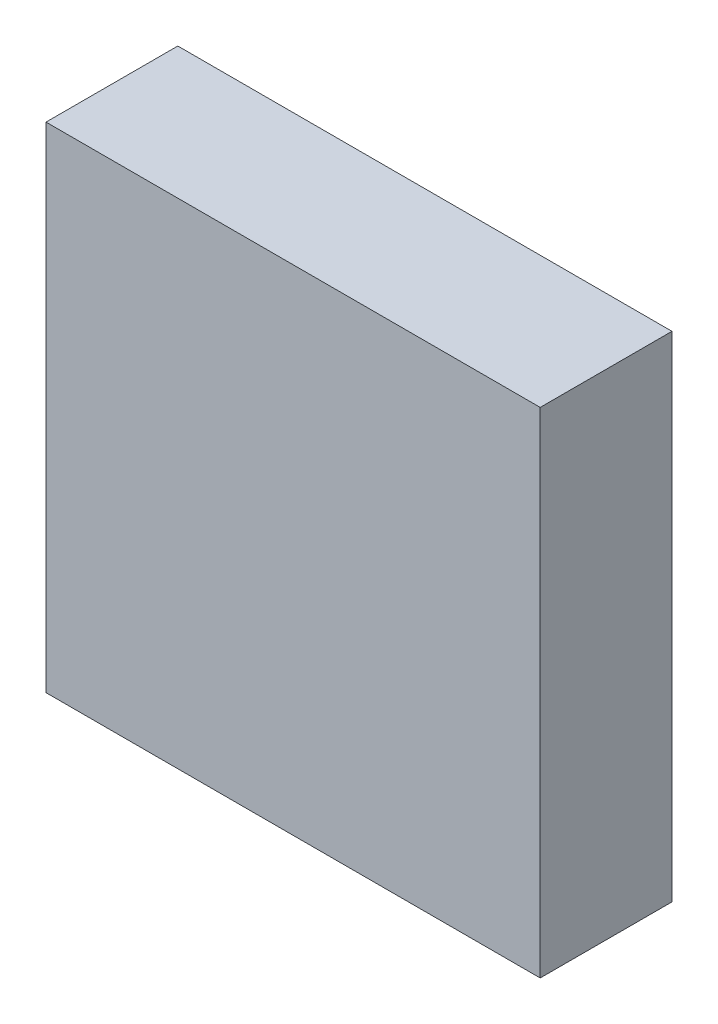
ISO-10303-21;
HEADER;
FILE_DESCRIPTION(('STEP AP214'),'2;1');
FILE_NAME('part.step','',(''),(''),'','','');
FILE_SCHEMA(('AUTOMOTIVE_DESIGN { 1 0 10303 214 1 1 1 1 }'));
ENDSEC;
DATA;
#1=APPLICATION_CONTEXT('core data for automotive mechanical design processes');
#2=APPLICATION_PROTOCOL_DEFINITION('international standard','automotive_design',2000,#1);
#3=PRODUCT_CONTEXT('',#1,'mechanical');
#4=PRODUCT('Part','Part','',(#3));
#5=PRODUCT_RELATED_PRODUCT_CATEGORY('part','',(#4));
#6=PRODUCT_DEFINITION_FORMATION('','',#4);
#7=PRODUCT_DEFINITION_CONTEXT('part definition',#1,'design');
#8=PRODUCT_DEFINITION('design','',#6,#7);
#9=PRODUCT_DEFINITION_SHAPE('','',#8);
#10=(LENGTH_UNIT() NAMED_UNIT(*) SI_UNIT(.MILLI.,.METRE.));
#11=(NAMED_UNIT(*) PLANE_ANGLE_UNIT() SI_UNIT($,.RADIAN.));
#12=(NAMED_UNIT(*) SI_UNIT($,.STERADIAN.) SOLID_ANGLE_UNIT());
#13=UNCERTAINTY_MEASURE_WITH_UNIT(LENGTH_MEASURE(1.E-05),#10,'distance_accuracy_value','');
#14=(GEOMETRIC_REPRESENTATION_CONTEXT(3) GLOBAL_UNCERTAINTY_ASSIGNED_CONTEXT((#13)) GLOBAL_UNIT_ASSIGNED_CONTEXT((#10,
#11,#12)) REPRESENTATION_CONTEXT('',''));
#15=CARTESIAN_POINT('',(0.,0.,0.));
#16=DIRECTION('',(0.,0.,1.));
#17=DIRECTION('',(1.,0.,0.));
#18=AXIS2_PLACEMENT_3D('',#15,#16,#17);
#19=CARTESIAN_POINT('',(0.,0.,40.));
#20=DIRECTION('',(1.,0.,0.));
#21=DIRECTION('',(0.,0.,-1.));
#22=AXIS2_PLACEMENT_3D('',#19,#20,#21);
#23=PLANE('',#22);
#24=DIRECTION('',(0.,-1.,0.));
#25=VECTOR('',#24,1.);
#26=CARTESIAN_POINT('',(0.,0.,0.));
#27=LINE('',#26,#25);
#28=CARTESIAN_POINT('',(0.,150.,0.));
#29=VERTEX_POINT('',#28);
#30=CARTESIAN_POINT('',(0.,0.,0.));
#31=VERTEX_POINT('',#30);
#32=EDGE_CURVE('E99',#29,#31,#27,.T.);
#33=ORIENTED_EDGE('',*,*,#32,.T.);
#34=DIRECTION('',(0.,0.,-1.));
#35=VECTOR('',#34,1.);
#36=CARTESIAN_POINT('',(0.,0.,40.));
#37=LINE('',#36,#35);
#38=CARTESIAN_POINT('',(0.,0.,40.));
#39=VERTEX_POINT('',#38);
#40=EDGE_CURVE('E11',#39,#31,#37,.T.);
#41=ORIENTED_EDGE('',*,*,#40,.F.);
#42=DIRECTION('',(0.,-1.,0.));
#43=VECTOR('',#42,1.);
#44=CARTESIAN_POINT('',(0.,0.,40.));
#45=LINE('',#44,#43);
#46=CARTESIAN_POINT('',(0.,150.,40.));
#47=VERTEX_POINT('',#46);
#48=EDGE_CURVE('E87',#47,#39,#45,.T.);
#49=ORIENTED_EDGE('',*,*,#48,.F.);
#50=DIRECTION('',(0.,0.,-1.));
#51=VECTOR('',#50,1.);
#52=CARTESIAN_POINT('',(0.,150.,40.));
#53=LINE('',#52,#51);
#54=EDGE_CURVE('E95',#47,#29,#53,.T.);
#55=ORIENTED_EDGE('',*,*,#54,.T.);
#56=EDGE_LOOP('',(#33,#41,#49,#55));
#57=FACE_BOUND('',#56,.T.);
#58=ADVANCED_FACE('F36',(#57),#23,.F.);
#59=CARTESIAN_POINT('',(0.,0.,40.));
#60=DIRECTION('',(0.,1.,0.));
#61=DIRECTION('',(0.,0.,1.));
#62=AXIS2_PLACEMENT_3D('',#59,#60,#61);
#63=PLANE('',#62);
#64=DIRECTION('',(1.,0.,0.));
#65=VECTOR('',#64,1.);
#66=CARTESIAN_POINT('',(0.,0.,0.));
#67=LINE('',#66,#65);
#68=CARTESIAN_POINT('',(150.,0.,0.));
#69=VERTEX_POINT('',#68);
#70=EDGE_CURVE('E91',#31,#69,#67,.T.);
#71=ORIENTED_EDGE('',*,*,#70,.T.);
#72=DIRECTION('',(0.,0.,-1.));
#73=VECTOR('',#72,1.);
#74=CARTESIAN_POINT('',(150.,0.,40.));
#75=LINE('',#74,#73);
#76=CARTESIAN_POINT('',(150.,0.,40.));
#77=VERTEX_POINT('',#76);
#78=EDGE_CURVE('E44',#77,#69,#75,.T.);
#79=ORIENTED_EDGE('',*,*,#78,.F.);
#80=DIRECTION('',(1.,0.,0.));
#81=VECTOR('',#80,1.);
#82=CARTESIAN_POINT('',(0.,0.,40.));
#83=LINE('',#82,#81);
#84=EDGE_CURVE('E82',#39,#77,#83,.T.);
#85=ORIENTED_EDGE('',*,*,#84,.F.);
#86=ORIENTED_EDGE('',*,*,#40,.T.);
#87=EDGE_LOOP('',(#71,#79,#85,#86));
#88=FACE_BOUND('',#87,.T.);
#89=ADVANCED_FACE('F90',(#88),#63,.F.);
#90=CARTESIAN_POINT('',(150.,0.,40.));
#91=DIRECTION('',(-1.,0.,0.));
#92=DIRECTION('',(0.,0.,1.));
#93=AXIS2_PLACEMENT_3D('',#90,#91,#92);
#94=PLANE('',#93);
#95=DIRECTION('',(0.,1.,0.));
#96=VECTOR('',#95,1.);
#97=CARTESIAN_POINT('',(150.,0.,0.));
#98=LINE('',#97,#96);
#99=CARTESIAN_POINT('',(150.,150.,0.));
#100=VERTEX_POINT('',#99);
#101=EDGE_CURVE('E69',#69,#100,#98,.T.);
#102=ORIENTED_EDGE('',*,*,#101,.T.);
#103=DIRECTION('',(0.,0.,-1.));
#104=VECTOR('',#103,1.);
#105=CARTESIAN_POINT('',(150.,150.,40.));
#106=LINE('',#105,#104);
#107=CARTESIAN_POINT('',(150.,150.,40.));
#108=VERTEX_POINT('',#107);
#109=EDGE_CURVE('E92',#108,#100,#106,.T.);
#110=ORIENTED_EDGE('',*,*,#109,.F.);
#111=DIRECTION('',(0.,1.,0.));
#112=VECTOR('',#111,1.);
#113=CARTESIAN_POINT('',(150.,0.,40.));
#114=LINE('',#113,#112);
#115=EDGE_CURVE('E85',#77,#108,#114,.T.);
#116=ORIENTED_EDGE('',*,*,#115,.F.);
#117=ORIENTED_EDGE('',*,*,#78,.T.);
#118=EDGE_LOOP('',(#102,#110,#116,#117));
#119=FACE_BOUND('',#118,.T.);
#120=ADVANCED_FACE('F93',(#119),#94,.F.);
#121=CARTESIAN_POINT('',(0.,150.,40.));
#122=DIRECTION('',(0.,-1.,0.));
#123=DIRECTION('',(0.,0.,-1.));
#124=AXIS2_PLACEMENT_3D('',#121,#122,#123);
#125=PLANE('',#124);
#126=DIRECTION('',(-1.,0.,0.));
#127=VECTOR('',#126,1.);
#128=CARTESIAN_POINT('',(0.,150.,0.));
#129=LINE('',#128,#127);
#130=EDGE_CURVE('E75',#100,#29,#129,.T.);
#131=ORIENTED_EDGE('',*,*,#130,.T.);
#132=ORIENTED_EDGE('',*,*,#54,.F.);
#133=DIRECTION('',(-1.,0.,0.));
#134=VECTOR('',#133,1.);
#135=CARTESIAN_POINT('',(0.,150.,40.));
#136=LINE('',#135,#134);
#137=EDGE_CURVE('E52',#108,#47,#136,.T.);
#138=ORIENTED_EDGE('',*,*,#137,.F.);
#139=ORIENTED_EDGE('',*,*,#109,.T.);
#140=EDGE_LOOP('',(#131,#132,#138,#139));
#141=FACE_BOUND('',#140,.T.);
#142=ADVANCED_FACE('F106',(#141),#125,.F.);
#143=CARTESIAN_POINT('',(0.,0.,40.));
#144=DIRECTION('',(0.,0.,-1.));
#145=DIRECTION('',(-1.,0.,0.));
#146=AXIS2_PLACEMENT_3D('',#143,#144,#145);
#147=PLANE('',#146);
#148=ORIENTED_EDGE('',*,*,#48,.T.);
#149=ORIENTED_EDGE('',*,*,#84,.T.);
#150=ORIENTED_EDGE('',*,*,#115,.T.);
#151=ORIENTED_EDGE('',*,*,#137,.T.);
#152=EDGE_LOOP('',(#148,#149,#150,#151));
#153=FACE_BOUND('',#152,.T.);
#154=ADVANCED_FACE('F83',(#153),#147,.F.);
#155=CARTESIAN_POINT('',(0.,0.,0.));
#156=DIRECTION('',(0.,0.,-1.));
#157=DIRECTION('',(-1.,0.,0.));
#158=AXIS2_PLACEMENT_3D('',#155,#156,#157);
#159=PLANE('',#158);
#160=ORIENTED_EDGE('',*,*,#32,.F.);
#161=ORIENTED_EDGE('',*,*,#130,.F.);
#162=ORIENTED_EDGE('',*,*,#101,.F.);
#163=ORIENTED_EDGE('',*,*,#70,.F.);
#164=EDGE_LOOP('',(#160,#161,#162,#163));
#165=FACE_BOUND('',#164,.T.);
#166=ADVANCED_FACE('F109',(#165),#159,.T.);
#167=CLOSED_SHELL('',(#58,#89,#120,#142,#154,#166));
#168=MANIFOLD_SOLID_BREP('B2',#167);
#169=ADVANCED_BREP_SHAPE_REPRESENTATION('',(#18,#168),#14);
#170=SHAPE_DEFINITION_REPRESENTATION(#9,#169);
ENDSEC;
END-ISO-10303-21;
